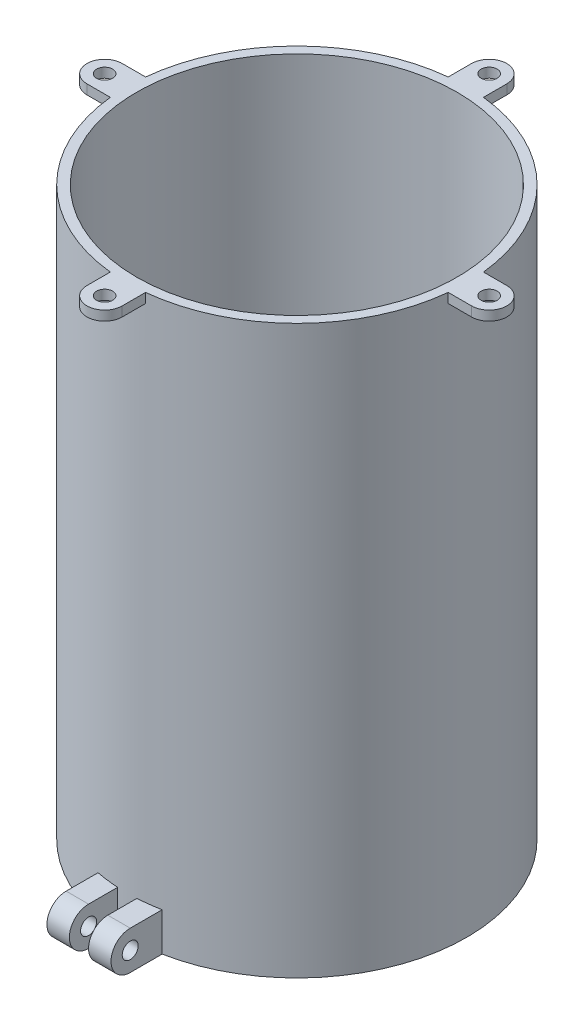
ISO-10303-21;
HEADER;
FILE_DESCRIPTION(('STEP AP214'),'2;1');
FILE_NAME('part.step','',(''),(''),'','','');
FILE_SCHEMA(('AUTOMOTIVE_DESIGN { 1 0 10303 214 1 1 1 1 }'));
ENDSEC;
DATA;
#1=APPLICATION_CONTEXT('core data for automotive mechanical design processes');
#2=APPLICATION_PROTOCOL_DEFINITION('international standard','automotive_design',2000,#1);
#3=PRODUCT_CONTEXT('',#1,'mechanical');
#4=PRODUCT('Part','Part','',(#3));
#5=PRODUCT_RELATED_PRODUCT_CATEGORY('part','',(#4));
#6=PRODUCT_DEFINITION_FORMATION('','',#4);
#7=PRODUCT_DEFINITION_CONTEXT('part definition',#1,'design');
#8=PRODUCT_DEFINITION('design','',#6,#7);
#9=PRODUCT_DEFINITION_SHAPE('','',#8);
#10=(LENGTH_UNIT() NAMED_UNIT(*) SI_UNIT(.MILLI.,.METRE.));
#11=(NAMED_UNIT(*) PLANE_ANGLE_UNIT() SI_UNIT($,.RADIAN.));
#12=(NAMED_UNIT(*) SI_UNIT($,.STERADIAN.) SOLID_ANGLE_UNIT());
#13=UNCERTAINTY_MEASURE_WITH_UNIT(LENGTH_MEASURE(1.E-05),#10,'distance_accuracy_value','');
#14=(GEOMETRIC_REPRESENTATION_CONTEXT(3) GLOBAL_UNCERTAINTY_ASSIGNED_CONTEXT((#13)) GLOBAL_UNIT_ASSIGNED_CONTEXT((#10,
#11,#12)) REPRESENTATION_CONTEXT('',''));
#15=CARTESIAN_POINT('',(0.,0.,0.));
#16=DIRECTION('',(0.,0.,1.));
#17=DIRECTION('',(1.,0.,0.));
#18=AXIS2_PLACEMENT_3D('',#15,#16,#17);
#19=CARTESIAN_POINT('',(-3.,0.,51.));
#20=DIRECTION('',(-1.,0.,0.));
#21=DIRECTION('',(0.,-1.,0.));
#22=AXIS2_PLACEMENT_3D('',#19,#20,#21);
#23=PLANE('',#22);
#24=CARTESIAN_POINT('',(-3.,6.,62.));
#25=DIRECTION('',(-1.,0.,0.));
#26=DIRECTION('',(0.,-1.,0.));
#27=AXIS2_PLACEMENT_3D('',#24,#25,#26);
#28=CIRCLE('',#27,2.5);
#29=CARTESIAN_POINT('',(-3.,3.5,62.));
#30=VERTEX_POINT('',#29);
#31=EDGE_CURVE('E452',#30,#30,#28,.T.);
#32=ORIENTED_EDGE('',*,*,#31,.T.);
#33=EDGE_LOOP('',(#32));
#34=FACE_BOUND('',#33,.T.);
#35=CARTESIAN_POINT('',(-3.,6.,62.));
#36=DIRECTION('',(-1.,0.,0.));
#37=DIRECTION('',(0.,-1.,0.));
#38=AXIS2_PLACEMENT_3D('',#35,#36,#37);
#39=CIRCLE('',#38,6.);
#40=CARTESIAN_POINT('',(-3.,0.,62.));
#41=VERTEX_POINT('',#40);
#42=CARTESIAN_POINT('',(-3.,12.,62.));
#43=VERTEX_POINT('',#42);
#44=EDGE_CURVE('E458',#41,#43,#39,.T.);
#45=ORIENTED_EDGE('',*,*,#44,.F.);
#46=DIRECTION('',(0.,0.,1.));
#47=VECTOR('',#46,1.);
#48=CARTESIAN_POINT('',(-3.,0.,51.));
#49=LINE('',#48,#47);
#50=CARTESIAN_POINT('',(-3.,0.,52.9150262212918));
#51=VERTEX_POINT('',#50);
#52=EDGE_CURVE('E267',#51,#41,#49,.T.);
#53=ORIENTED_EDGE('',*,*,#52,.F.);
#54=DIRECTION('',(0.,-1.,0.));
#55=VECTOR('',#54,1.);
#56=CARTESIAN_POINT('',(-3.00000000000002,176.9,52.9150262212918));
#57=LINE('',#56,#55);
#58=CARTESIAN_POINT('',(-3.,12.,52.9150262212918));
#59=VERTEX_POINT('',#58);
#60=EDGE_CURVE('E282',#51,#59,#57,.F.);
#61=ORIENTED_EDGE('',*,*,#60,.T.);
#62=DIRECTION('',(0.,0.,1.));
#63=VECTOR('',#62,1.);
#64=CARTESIAN_POINT('',(-3.,12.,51.));
#65=LINE('',#64,#63);
#66=EDGE_CURVE('E274',#59,#43,#65,.T.);
#67=ORIENTED_EDGE('',*,*,#66,.T.);
#68=EDGE_LOOP('',(#45,#53,#61,#67));
#69=FACE_BOUND('',#68,.T.);
#70=ADVANCED_FACE('F84',(#34,#69),#23,.F.);
#71=CARTESIAN_POINT('',(-10.,0.,51.));
#72=DIRECTION('',(1.,0.,0.));
#73=DIRECTION('',(0.,0.,-1.));
#74=AXIS2_PLACEMENT_3D('',#71,#72,#73);
#75=PLANE('',#74);
#76=CARTESIAN_POINT('',(-10.,6.,62.));
#77=DIRECTION('',(-1.,0.,0.));
#78=DIRECTION('',(0.,0.,1.));
#79=AXIS2_PLACEMENT_3D('',#76,#77,#78);
#80=CIRCLE('',#79,2.5);
#81=CARTESIAN_POINT('',(-10.,6.,64.5));
#82=VERTEX_POINT('',#81);
#83=EDGE_CURVE('E465',#82,#82,#80,.T.);
#84=ORIENTED_EDGE('',*,*,#83,.F.);
#85=EDGE_LOOP('',(#84));
#86=FACE_BOUND('',#85,.T.);
#87=DIRECTION('',(0.,0.,1.));
#88=VECTOR('',#87,1.);
#89=CARTESIAN_POINT('',(-10.,0.,51.));
#90=LINE('',#89,#88);
#91=CARTESIAN_POINT('',(-10.,0.,52.0480547186924));
#92=VERTEX_POINT('',#91);
#93=CARTESIAN_POINT('',(-10.,0.,62.));
#94=VERTEX_POINT('',#93);
#95=EDGE_CURVE('E264',#92,#94,#90,.T.);
#96=ORIENTED_EDGE('',*,*,#95,.T.);
#97=CARTESIAN_POINT('',(-10.,6.,62.));
#98=DIRECTION('',(-1.,0.,0.));
#99=DIRECTION('',(0.,0.,1.));
#100=AXIS2_PLACEMENT_3D('',#97,#98,#99);
#101=CIRCLE('',#100,6.);
#102=CARTESIAN_POINT('',(-10.,12.,62.));
#103=VERTEX_POINT('',#102);
#104=EDGE_CURVE('E248',#94,#103,#101,.T.);
#105=ORIENTED_EDGE('',*,*,#104,.T.);
#106=DIRECTION('',(0.,0.,1.));
#107=VECTOR('',#106,1.);
#108=CARTESIAN_POINT('',(-10.,12.,51.));
#109=LINE('',#108,#107);
#110=CARTESIAN_POINT('',(-10.,12.,52.0480547186924));
#111=VERTEX_POINT('',#110);
#112=EDGE_CURVE('E271',#111,#103,#109,.T.);
#113=ORIENTED_EDGE('',*,*,#112,.F.);
#114=DIRECTION('',(0.,-1.,0.));
#115=VECTOR('',#114,1.);
#116=CARTESIAN_POINT('',(-10.,176.9,52.0480547186924));
#117=LINE('',#116,#115);
#118=EDGE_CURVE('E270',#111,#92,#117,.T.);
#119=ORIENTED_EDGE('',*,*,#118,.T.);
#120=EDGE_LOOP('',(#96,#105,#113,#119));
#121=FACE_BOUND('',#120,.T.);
#122=ADVANCED_FACE('F269',(#86,#121),#75,.F.);
#123=CARTESIAN_POINT('',(3.,0.,68.));
#124=DIRECTION('',(1.,0.,0.));
#125=DIRECTION('',(0.,1.,0.));
#126=AXIS2_PLACEMENT_3D('',#123,#124,#125);
#127=PLANE('',#126);
#128=CARTESIAN_POINT('',(3.,6.,62.));
#129=DIRECTION('',(1.,0.,0.));
#130=DIRECTION('',(0.,1.,0.));
#131=AXIS2_PLACEMENT_3D('',#128,#129,#130);
#132=CIRCLE('',#131,2.5);
#133=CARTESIAN_POINT('',(3.,8.5,62.));
#134=VERTEX_POINT('',#133);
#135=EDGE_CURVE('E455',#134,#134,#132,.T.);
#136=ORIENTED_EDGE('',*,*,#135,.T.);
#137=EDGE_LOOP('',(#136));
#138=FACE_BOUND('',#137,.T.);
#139=DIRECTION('',(0.,0.,-1.));
#140=VECTOR('',#139,1.);
#141=CARTESIAN_POINT('',(3.,0.,68.));
#142=LINE('',#141,#140);
#143=CARTESIAN_POINT('',(3.,0.,62.));
#144=VERTEX_POINT('',#143);
#145=CARTESIAN_POINT('',(3.,0.,52.9150262212918));
#146=VERTEX_POINT('',#145);
#147=EDGE_CURVE('E446',#144,#146,#142,.T.);
#148=ORIENTED_EDGE('',*,*,#147,.F.);
#149=CARTESIAN_POINT('',(3.,6.,62.));
#150=DIRECTION('',(1.,0.,0.));
#151=DIRECTION('',(0.,1.,0.));
#152=AXIS2_PLACEMENT_3D('',#149,#150,#151);
#153=CIRCLE('',#152,6.);
#154=CARTESIAN_POINT('',(3.,12.,62.));
#155=VERTEX_POINT('',#154);
#156=EDGE_CURVE('E460',#155,#144,#153,.T.);
#157=ORIENTED_EDGE('',*,*,#156,.F.);
#158=DIRECTION('',(0.,0.,-1.));
#159=VECTOR('',#158,1.);
#160=CARTESIAN_POINT('',(3.,12.,68.));
#161=LINE('',#160,#159);
#162=CARTESIAN_POINT('',(3.,12.,52.9150262212918));
#163=VERTEX_POINT('',#162);
#164=EDGE_CURVE('E99',#155,#163,#161,.T.);
#165=ORIENTED_EDGE('',*,*,#164,.T.);
#166=DIRECTION('',(0.,-1.,0.));
#167=VECTOR('',#166,1.);
#168=CARTESIAN_POINT('',(2.99999999999998,176.9,52.9150262212918));
#169=LINE('',#168,#167);
#170=EDGE_CURVE('E280',#163,#146,#169,.T.);
#171=ORIENTED_EDGE('',*,*,#170,.T.);
#172=EDGE_LOOP('',(#148,#157,#165,#171));
#173=FACE_BOUND('',#172,.T.);
#174=ADVANCED_FACE('F476',(#138,#173),#127,.F.);
#175=CARTESIAN_POINT('',(10.,0.,68.));
#176=DIRECTION('',(-1.,0.,0.));
#177=DIRECTION('',(0.,-1.,0.));
#178=AXIS2_PLACEMENT_3D('',#175,#176,#177);
#179=PLANE('',#178);
#180=CARTESIAN_POINT('',(10.,6.,62.));
#181=DIRECTION('',(-1.,0.,0.));
#182=DIRECTION('',(0.,-1.,0.));
#183=AXIS2_PLACEMENT_3D('',#180,#181,#182);
#184=CIRCLE('',#183,2.5);
#185=CARTESIAN_POINT('',(10.,3.5,62.));
#186=VERTEX_POINT('',#185);
#187=EDGE_CURVE('E462',#186,#186,#184,.F.);
#188=ORIENTED_EDGE('',*,*,#187,.F.);
#189=EDGE_LOOP('',(#188));
#190=FACE_BOUND('',#189,.T.);
#191=CARTESIAN_POINT('',(10.,6.,62.));
#192=DIRECTION('',(-1.,0.,0.));
#193=DIRECTION('',(0.,-1.,0.));
#194=AXIS2_PLACEMENT_3D('',#191,#192,#193);
#195=CIRCLE('',#194,6.);
#196=CARTESIAN_POINT('',(10.,12.,62.));
#197=VERTEX_POINT('',#196);
#198=CARTESIAN_POINT('',(10.,0.,62.));
#199=VERTEX_POINT('',#198);
#200=EDGE_CURVE('E468',#197,#199,#195,.F.);
#201=ORIENTED_EDGE('',*,*,#200,.T.);
#202=DIRECTION('',(0.,0.,-1.));
#203=VECTOR('',#202,1.);
#204=CARTESIAN_POINT('',(10.,0.,68.));
#205=LINE('',#204,#203);
#206=CARTESIAN_POINT('',(10.,0.,52.0480547186924));
#207=VERTEX_POINT('',#206);
#208=EDGE_CURVE('E107',#199,#207,#205,.T.);
#209=ORIENTED_EDGE('',*,*,#208,.T.);
#210=DIRECTION('',(0.,-1.,0.));
#211=VECTOR('',#210,1.);
#212=CARTESIAN_POINT('',(9.99999999999998,176.9,52.0480547186924));
#213=LINE('',#212,#211);
#214=CARTESIAN_POINT('',(10.,12.,52.0480547186924));
#215=VERTEX_POINT('',#214);
#216=EDGE_CURVE('E440',#207,#215,#213,.F.);
#217=ORIENTED_EDGE('',*,*,#216,.T.);
#218=DIRECTION('',(0.,0.,-1.));
#219=VECTOR('',#218,1.);
#220=CARTESIAN_POINT('',(10.,12.,68.));
#221=LINE('',#220,#219);
#222=EDGE_CURVE('E444',#197,#215,#221,.T.);
#223=ORIENTED_EDGE('',*,*,#222,.F.);
#224=EDGE_LOOP('',(#201,#209,#217,#223));
#225=FACE_BOUND('',#224,.T.);
#226=ADVANCED_FACE('F443',(#190,#225),#179,.F.);
#227=CARTESIAN_POINT('',(0.,12.,51.));
#228=DIRECTION('',(0.,-1.,0.));
#229=DIRECTION('',(0.,0.,-1.));
#230=AXIS2_PLACEMENT_3D('',#227,#228,#229);
#231=PLANE('',#230);
#232=DIRECTION('',(-1.,0.,0.));
#233=VECTOR('',#232,1.);
#234=CARTESIAN_POINT('',(18.4852813742386,12.,62.));
#235=LINE('',#234,#233);
#236=EDGE_CURVE('E252',#43,#103,#235,.T.);
#237=ORIENTED_EDGE('',*,*,#236,.F.);
#238=ORIENTED_EDGE('',*,*,#66,.F.);
#239=CARTESIAN_POINT('',(0.,12.,0.));
#240=DIRECTION('',(0.,-1.,0.));
#241=DIRECTION('',(0.,0.,-1.));
#242=AXIS2_PLACEMENT_3D('',#239,#240,#241);
#243=CIRCLE('',#242,53.);
#244=EDGE_CURVE('E430',#59,#111,#243,.T.);
#245=ORIENTED_EDGE('',*,*,#244,.T.);
#246=ORIENTED_EDGE('',*,*,#112,.T.);
#247=EDGE_LOOP('',(#237,#238,#245,#246));
#248=FACE_BOUND('',#247,.T.);
#249=ADVANCED_FACE('F504',(#248),#231,.F.);
#250=CARTESIAN_POINT('',(0.,176.9,0.));
#251=DIRECTION('',(0.,-1.,0.));
#252=DIRECTION('',(0.,0.,-1.));
#253=AXIS2_PLACEMENT_3D('',#250,#251,#252);
#254=CYLINDRICAL_SURFACE('',#253,53.);
#255=DIRECTION('',(0.,1.,0.));
#256=VECTOR('',#255,1.);
#257=CARTESIAN_POINT('',(-5.49999999997042,173.9,52.7138501724198));
#258=LINE('',#257,#256);
#259=CARTESIAN_POINT('',(-5.49999999997042,173.9,52.7138501724198));
#260=VERTEX_POINT('',#259);
#261=CARTESIAN_POINT('',(-5.49999999997042,176.9,52.7138501724198));
#262=VERTEX_POINT('',#261);
#263=EDGE_CURVE('E309',#260,#262,#258,.T.);
#264=ORIENTED_EDGE('',*,*,#263,.T.);
#265=CARTESIAN_POINT('',(0.,176.9,0.));
#266=DIRECTION('',(0.,1.,0.));
#267=DIRECTION('',(0.,0.,1.));
#268=AXIS2_PLACEMENT_3D('',#265,#266,#267);
#269=CIRCLE('',#268,53.);
#270=CARTESIAN_POINT('',(-52.7138501724153,176.9,5.50000000001421));
#271=VERTEX_POINT('',#270);
#272=EDGE_CURVE('E427',#271,#262,#269,.T.);
#273=ORIENTED_EDGE('',*,*,#272,.F.);
#274=DIRECTION('',(0.,1.,0.));
#275=VECTOR('',#274,1.);
#276=CARTESIAN_POINT('',(-52.7138501724153,173.9,5.50000000001421));
#277=LINE('',#276,#275);
#278=CARTESIAN_POINT('',(-52.7138501724153,173.9,5.50000000001421));
#279=VERTEX_POINT('',#278);
#280=EDGE_CURVE('E415',#279,#271,#277,.T.);
#281=ORIENTED_EDGE('',*,*,#280,.F.);
#282=CARTESIAN_POINT('',(0.,173.9,0.));
#283=DIRECTION('',(0.,1.,0.));
#284=DIRECTION('',(0.,0.,1.));
#285=AXIS2_PLACEMENT_3D('',#282,#283,#284);
#286=CIRCLE('',#285,53.);
#287=CARTESIAN_POINT('',(-52.7138501724182,173.9,-5.49999999998579));
#288=VERTEX_POINT('',#287);
#289=EDGE_CURVE('E399',#288,#279,#286,.T.);
#290=ORIENTED_EDGE('',*,*,#289,.F.);
#291=DIRECTION('',(0.,1.,0.));
#292=VECTOR('',#291,1.);
#293=CARTESIAN_POINT('',(-52.7138501724182,173.9,-5.49999999998579));
#294=LINE('',#293,#292);
#295=CARTESIAN_POINT('',(-52.7138501724182,176.9,-5.49999999998579));
#296=VERTEX_POINT('',#295);
#297=EDGE_CURVE('E411',#288,#296,#294,.T.);
#298=ORIENTED_EDGE('',*,*,#297,.T.);
#299=CARTESIAN_POINT('',(-5.5,176.9,-52.7138501724167));
#300=VERTEX_POINT('',#299);
#301=EDGE_CURVE('E432',#300,#296,#269,.T.);
#302=ORIENTED_EDGE('',*,*,#301,.F.);
#303=DIRECTION('',(0.,1.,0.));
#304=VECTOR('',#303,1.);
#305=CARTESIAN_POINT('',(-5.5,173.9,-52.7138501724167));
#306=LINE('',#305,#304);
#307=CARTESIAN_POINT('',(-5.5,173.9,-52.7138501724167));
#308=VERTEX_POINT('',#307);
#309=EDGE_CURVE('E381',#308,#300,#306,.T.);
#310=ORIENTED_EDGE('',*,*,#309,.F.);
#311=CARTESIAN_POINT('',(0.,173.9,0.));
#312=DIRECTION('',(0.,1.,0.));
#313=DIRECTION('',(0.,0.,1.));
#314=AXIS2_PLACEMENT_3D('',#311,#312,#313);
#315=CIRCLE('',#314,53.);
#316=CARTESIAN_POINT('',(5.5,173.9,-52.7138501724167));
#317=VERTEX_POINT('',#316);
#318=EDGE_CURVE('E365',#317,#308,#315,.T.);
#319=ORIENTED_EDGE('',*,*,#318,.F.);
#320=DIRECTION('',(0.,1.,0.));
#321=VECTOR('',#320,1.);
#322=CARTESIAN_POINT('',(5.5,173.9,-52.7138501724167));
#323=LINE('',#322,#321);
#324=CARTESIAN_POINT('',(5.5,176.9,-52.7138501724167));
#325=VERTEX_POINT('',#324);
#326=EDGE_CURVE('E377',#317,#325,#323,.T.);
#327=ORIENTED_EDGE('',*,*,#326,.T.);
#328=CARTESIAN_POINT('',(52.7138501724151,176.9,-5.50000000001537));
#329=VERTEX_POINT('',#328);
#330=EDGE_CURVE('E889',#329,#325,#269,.T.);
#331=ORIENTED_EDGE('',*,*,#330,.F.);
#332=DIRECTION('',(0.,1.,0.));
#333=VECTOR('',#332,1.);
#334=CARTESIAN_POINT('',(52.7138501724151,173.9,-5.50000000001537));
#335=LINE('',#334,#333);
#336=CARTESIAN_POINT('',(52.7138501724151,173.9,-5.50000000001537));
#337=VERTEX_POINT('',#336);
#338=EDGE_CURVE('E347',#337,#329,#335,.T.);
#339=ORIENTED_EDGE('',*,*,#338,.F.);
#340=CARTESIAN_POINT('',(0.,173.9,0.));
#341=DIRECTION('',(0.,1.,0.));
#342=DIRECTION('',(0.,0.,1.));
#343=AXIS2_PLACEMENT_3D('',#340,#341,#342);
#344=CIRCLE('',#343,53.);
#345=CARTESIAN_POINT('',(52.7138501724183,173.9,5.49999999998463));
#346=VERTEX_POINT('',#345);
#347=EDGE_CURVE('E331',#346,#337,#344,.T.);
#348=ORIENTED_EDGE('',*,*,#347,.F.);
#349=DIRECTION('',(0.,1.,0.));
#350=VECTOR('',#349,1.);
#351=CARTESIAN_POINT('',(52.7138501724183,173.9,5.49999999998463));
#352=LINE('',#351,#350);
#353=CARTESIAN_POINT('',(52.7138501724183,176.9,5.49999999998463));
#354=VERTEX_POINT('',#353);
#355=EDGE_CURVE('E343',#346,#354,#352,.T.);
#356=ORIENTED_EDGE('',*,*,#355,.T.);
#357=CARTESIAN_POINT('',(5.50000000002958,176.9,52.7138501724137));
#358=VERTEX_POINT('',#357);
#359=EDGE_CURVE('E431',#358,#354,#269,.T.);
#360=ORIENTED_EDGE('',*,*,#359,.F.);
#361=DIRECTION('',(0.,1.,0.));
#362=VECTOR('',#361,1.);
#363=CARTESIAN_POINT('',(5.50000000002958,173.9,52.7138501724137));
#364=LINE('',#363,#362);
#365=CARTESIAN_POINT('',(5.50000000002958,173.9,52.7138501724137));
#366=VERTEX_POINT('',#365);
#367=EDGE_CURVE('E313',#366,#358,#364,.T.);
#368=ORIENTED_EDGE('',*,*,#367,.F.);
#369=CARTESIAN_POINT('',(0.,173.9,0.));
#370=DIRECTION('',(0.,1.,0.));
#371=DIRECTION('',(0.,0.,1.));
#372=AXIS2_PLACEMENT_3D('',#369,#370,#371);
#373=CIRCLE('',#372,53.);
#374=EDGE_CURVE('E298',#260,#366,#373,.T.);
#375=ORIENTED_EDGE('',*,*,#374,.F.);
#376=EDGE_LOOP('',(#264,#273,#281,#290,#298,#302,#310,#319,#327,#331,#339,#348,#356,#360,#368,#375));
#377=FACE_BOUND('',#376,.T.);
#378=ORIENTED_EDGE('',*,*,#170,.F.);
#379=CARTESIAN_POINT('',(0.,12.,0.));
#380=DIRECTION('',(0.,1.,0.));
#381=DIRECTION('',(0.,0.,1.));
#382=AXIS2_PLACEMENT_3D('',#379,#380,#381);
#383=CIRCLE('',#382,53.);
#384=EDGE_CURVE('E92',#163,#215,#383,.T.);
#385=ORIENTED_EDGE('',*,*,#384,.T.);
#386=ORIENTED_EDGE('',*,*,#216,.F.);
#387=CARTESIAN_POINT('',(0.,0.,0.));
#388=DIRECTION('',(0.,1.,0.));
#389=DIRECTION('',(0.,0.,1.));
#390=AXIS2_PLACEMENT_3D('',#387,#388,#389);
#391=CIRCLE('',#390,53.);
#392=EDGE_CURVE('E424',#207,#92,#391,.T.);
#393=ORIENTED_EDGE('',*,*,#392,.T.);
#394=ORIENTED_EDGE('',*,*,#118,.F.);
#395=ORIENTED_EDGE('',*,*,#244,.F.);
#396=ORIENTED_EDGE('',*,*,#60,.F.);
#397=EDGE_CURVE('E433',#51,#146,#391,.T.);
#398=ORIENTED_EDGE('',*,*,#397,.T.);
#399=EDGE_LOOP('',(#378,#385,#386,#393,#394,#395,#396,#398));
#400=FACE_BOUND('',#399,.T.);
#401=ADVANCED_FACE('F86',(#377,#400),#254,.T.);
#402=CARTESIAN_POINT('',(0.,176.9,0.));
#403=DIRECTION('',(0.,1.,0.));
#404=DIRECTION('',(0.,0.,1.));
#405=AXIS2_PLACEMENT_3D('',#402,#403,#404);
#406=PLANE('',#405);
#407=ORIENTED_EDGE('',*,*,#272,.T.);
#408=DIRECTION('',(0.,0.,-1.));
#409=VECTOR('',#408,1.);
#410=CARTESIAN_POINT('',(-5.49999999997043,176.9,0.));
#411=LINE('',#410,#409);
#412=CARTESIAN_POINT('',(-5.49999999997042,176.9,59.9999999999988));
#413=VERTEX_POINT('',#412);
#414=EDGE_CURVE('E303',#413,#262,#411,.T.);
#415=ORIENTED_EDGE('',*,*,#414,.F.);
#416=CARTESIAN_POINT('',(2.95843831461994E-11,176.9,59.9999999999988));
#417=DIRECTION('',(0.,1.,0.));
#418=DIRECTION('',(0.,0.,1.));
#419=AXIS2_PLACEMENT_3D('',#416,#417,#418);
#420=CIRCLE('',#419,5.5);
#421=CARTESIAN_POINT('',(5.50000000002958,176.9,59.9999999999988));
#422=VERTEX_POINT('',#421);
#423=EDGE_CURVE('E305',#413,#422,#420,.T.);
#424=ORIENTED_EDGE('',*,*,#423,.T.);
#425=DIRECTION('',(0.,0.,-1.));
#426=VECTOR('',#425,1.);
#427=CARTESIAN_POINT('',(5.50000000002957,176.9,0.));
#428=LINE('',#427,#426);
#429=EDGE_CURVE('E290',#422,#358,#428,.T.);
#430=ORIENTED_EDGE('',*,*,#429,.T.);
#431=ORIENTED_EDGE('',*,*,#359,.T.);
#432=DIRECTION('',(-1.,0.,0.));
#433=VECTOR('',#432,1.);
#434=CARTESIAN_POINT('',(0.,176.9,5.49999999998463));
#435=LINE('',#434,#433);
#436=CARTESIAN_POINT('',(60.0000000000142,176.9,5.49999999998462));
#437=VERTEX_POINT('',#436);
#438=EDGE_CURVE('E336',#437,#354,#435,.T.);
#439=ORIENTED_EDGE('',*,*,#438,.F.);
#440=CARTESIAN_POINT('',(60.0000000000142,176.9,-1.53750586610279E-11));
#441=DIRECTION('',(0.,1.,0.));
#442=DIRECTION('',(0.,0.,1.));
#443=AXIS2_PLACEMENT_3D('',#440,#441,#442);
#444=CIRCLE('',#443,5.5);
#445=CARTESIAN_POINT('',(60.0000000000142,176.9,-5.50000000001537));
#446=VERTEX_POINT('',#445);
#447=EDGE_CURVE('E339',#437,#446,#444,.T.);
#448=ORIENTED_EDGE('',*,*,#447,.T.);
#449=DIRECTION('',(-1.,0.,0.));
#450=VECTOR('',#449,1.);
#451=CARTESIAN_POINT('',(0.,176.9,-5.50000000001537));
#452=LINE('',#451,#450);
#453=EDGE_CURVE('E323',#446,#329,#452,.T.);
#454=ORIENTED_EDGE('',*,*,#453,.T.);
#455=ORIENTED_EDGE('',*,*,#330,.T.);
#456=DIRECTION('',(0.,0.,1.));
#457=VECTOR('',#456,1.);
#458=CARTESIAN_POINT('',(5.5,176.9,0.));
#459=LINE('',#458,#457);
#460=CARTESIAN_POINT('',(5.5,176.9,-60.));
#461=VERTEX_POINT('',#460);
#462=EDGE_CURVE('E370',#461,#325,#459,.T.);
#463=ORIENTED_EDGE('',*,*,#462,.F.);
#464=CARTESIAN_POINT('',(0.,176.9,-60.));
#465=DIRECTION('',(0.,1.,0.));
#466=DIRECTION('',(0.,0.,1.));
#467=AXIS2_PLACEMENT_3D('',#464,#465,#466);
#468=CIRCLE('',#467,5.5);
#469=CARTESIAN_POINT('',(-5.5,176.9,-60.));
#470=VERTEX_POINT('',#469);
#471=EDGE_CURVE('E373',#461,#470,#468,.T.);
#472=ORIENTED_EDGE('',*,*,#471,.T.);
#473=DIRECTION('',(0.,0.,1.));
#474=VECTOR('',#473,1.);
#475=CARTESIAN_POINT('',(-5.5,176.9,0.));
#476=LINE('',#475,#474);
#477=EDGE_CURVE('E357',#470,#300,#476,.T.);
#478=ORIENTED_EDGE('',*,*,#477,.T.);
#479=ORIENTED_EDGE('',*,*,#301,.T.);
#480=DIRECTION('',(1.,0.,0.));
#481=VECTOR('',#480,1.);
#482=CARTESIAN_POINT('',(0.,176.9,-5.4999999999858));
#483=LINE('',#482,#481);
#484=CARTESIAN_POINT('',(-59.9999999999846,176.9,-5.49999999998578));
#485=VERTEX_POINT('',#484);
#486=EDGE_CURVE('E404',#485,#296,#483,.T.);
#487=ORIENTED_EDGE('',*,*,#486,.F.);
#488=CARTESIAN_POINT('',(-59.9999999999846,176.9,1.42166723659664E-11));
#489=DIRECTION('',(0.,1.,0.));
#490=DIRECTION('',(0.,0.,1.));
#491=AXIS2_PLACEMENT_3D('',#488,#489,#490);
#492=CIRCLE('',#491,5.5);
#493=CARTESIAN_POINT('',(-59.9999999999846,176.9,5.50000000001422));
#494=VERTEX_POINT('',#493);
#495=EDGE_CURVE('E407',#485,#494,#492,.T.);
#496=ORIENTED_EDGE('',*,*,#495,.T.);
#497=DIRECTION('',(1.,0.,0.));
#498=VECTOR('',#497,1.);
#499=CARTESIAN_POINT('',(0.,176.9,5.50000000001419));
#500=LINE('',#499,#498);
#501=EDGE_CURVE('E391',#494,#271,#500,.T.);
#502=ORIENTED_EDGE('',*,*,#501,.T.);
#503=EDGE_LOOP('',(#407,#415,#424,#430,#431,#439,#448,#454,#455,#463,#472,#478,#479,#487,#496,#502));
#504=FACE_BOUND('',#503,.T.);
#505=CARTESIAN_POINT('',(0.,176.9,0.));
#506=DIRECTION('',(0.,1.,0.));
#507=DIRECTION('',(0.,0.,1.));
#508=AXIS2_PLACEMENT_3D('',#505,#506,#507);
#509=CIRCLE('',#508,50.);
#510=CARTESIAN_POINT('',(0.,176.9,50.));
#511=VERTEX_POINT('',#510);
#512=EDGE_CURVE('E421',#511,#511,#509,.T.);
#513=ORIENTED_EDGE('',*,*,#512,.F.);
#514=EDGE_LOOP('',(#513));
#515=FACE_BOUND('',#514,.T.);
#516=CARTESIAN_POINT('',(-59.9999999999846,176.9,1.42166723659664E-11));
#517=DIRECTION('',(0.,1.,0.));
#518=DIRECTION('',(0.,0.,1.));
#519=AXIS2_PLACEMENT_3D('',#516,#517,#518);
#520=CIRCLE('',#519,2.50000000001868);
#521=CARTESIAN_POINT('',(-59.9999999999846,176.9,2.5000000000329));
#522=VERTEX_POINT('',#521);
#523=EDGE_CURVE('E380',#522,#522,#520,.T.);
#524=ORIENTED_EDGE('',*,*,#523,.F.);
#525=EDGE_LOOP('',(#524));
#526=FACE_BOUND('',#525,.T.);
#527=CARTESIAN_POINT('',(0.,176.9,-60.));
#528=DIRECTION('',(0.,1.,0.));
#529=DIRECTION('',(0.,0.,1.));
#530=AXIS2_PLACEMENT_3D('',#527,#528,#529);
#531=CIRCLE('',#530,2.5);
#532=CARTESIAN_POINT('',(0.,176.9,-57.5));
#533=VERTEX_POINT('',#532);
#534=EDGE_CURVE('E346',#533,#533,#531,.T.);
#535=ORIENTED_EDGE('',*,*,#534,.F.);
#536=EDGE_LOOP('',(#535));
#537=FACE_BOUND('',#536,.T.);
#538=CARTESIAN_POINT('',(60.0000000000142,176.9,-1.53750586610279E-11));
#539=DIRECTION('',(0.,1.,0.));
#540=DIRECTION('',(0.,0.,1.));
#541=AXIS2_PLACEMENT_3D('',#538,#539,#540);
#542=CIRCLE('',#541,2.50000000001075);
#543=CARTESIAN_POINT('',(60.0000000000142,176.9,2.49999999999538));
#544=VERTEX_POINT('',#543);
#545=EDGE_CURVE('E312',#544,#544,#542,.T.);
#546=ORIENTED_EDGE('',*,*,#545,.F.);
#547=EDGE_LOOP('',(#546));
#548=FACE_BOUND('',#547,.T.);
#549=CARTESIAN_POINT('',(2.95843831461994E-11,176.9,59.9999999999988));
#550=DIRECTION('',(0.,1.,0.));
#551=DIRECTION('',(0.,0.,1.));
#552=AXIS2_PLACEMENT_3D('',#549,#550,#551);
#553=CIRCLE('',#552,2.50000000002903);
#554=CARTESIAN_POINT('',(2.95843831461994E-11,176.9,62.5000000000279));
#555=VERTEX_POINT('',#554);
#556=EDGE_CURVE('E285',#555,#555,#553,.T.);
#557=ORIENTED_EDGE('',*,*,#556,.F.);
#558=EDGE_LOOP('',(#557));
#559=FACE_BOUND('',#558,.T.);
#560=ADVANCED_FACE('F588',(#504,#515,#526,#537,#548,#559),#406,.T.);
#561=CARTESIAN_POINT('',(0.,0.,0.));
#562=DIRECTION('',(0.,1.,0.));
#563=DIRECTION('',(0.,0.,1.));
#564=AXIS2_PLACEMENT_3D('',#561,#562,#563);
#565=PLANE('',#564);
#566=ORIENTED_EDGE('',*,*,#208,.F.);
#567=DIRECTION('',(-1.,0.,0.));
#568=VECTOR('',#567,1.);
#569=CARTESIAN_POINT('',(18.4852813742386,0.,62.));
#570=LINE('',#569,#568);
#571=EDGE_CURVE('E257',#199,#144,#570,.T.);
#572=ORIENTED_EDGE('',*,*,#571,.T.);
#573=ORIENTED_EDGE('',*,*,#147,.T.);
#574=ORIENTED_EDGE('',*,*,#397,.F.);
#575=ORIENTED_EDGE('',*,*,#52,.T.);
#576=DIRECTION('',(-1.,0.,0.));
#577=VECTOR('',#576,1.);
#578=CARTESIAN_POINT('',(18.4852813742386,0.,62.));
#579=LINE('',#578,#577);
#580=EDGE_CURVE('E12',#41,#94,#579,.T.);
#581=ORIENTED_EDGE('',*,*,#580,.T.);
#582=ORIENTED_EDGE('',*,*,#95,.F.);
#583=ORIENTED_EDGE('',*,*,#392,.F.);
#584=EDGE_LOOP('',(#566,#572,#573,#574,#575,#581,#582,#583));
#585=FACE_BOUND('',#584,.T.);
#586=CARTESIAN_POINT('',(0.,0.,0.));
#587=DIRECTION('',(0.,1.,0.));
#588=DIRECTION('',(0.,0.,1.));
#589=AXIS2_PLACEMENT_3D('',#586,#587,#588);
#590=CIRCLE('',#589,50.);
#591=CARTESIAN_POINT('',(0.,0.,50.));
#592=VERTEX_POINT('',#591);
#593=EDGE_CURVE('E414',#592,#592,#590,.T.);
#594=ORIENTED_EDGE('',*,*,#593,.T.);
#595=EDGE_LOOP('',(#594));
#596=FACE_BOUND('',#595,.T.);
#597=ADVANCED_FACE('F261',(#585,#596),#565,.F.);
#598=CARTESIAN_POINT('',(0.,176.9,0.));
#599=DIRECTION('',(0.,-1.,0.));
#600=DIRECTION('',(0.,0.,-1.));
#601=AXIS2_PLACEMENT_3D('',#598,#599,#600);
#602=CYLINDRICAL_SURFACE('',#601,50.);
#603=ORIENTED_EDGE('',*,*,#512,.T.);
#604=EDGE_LOOP('',(#603));
#605=FACE_BOUND('',#604,.T.);
#606=ORIENTED_EDGE('',*,*,#593,.F.);
#607=EDGE_LOOP('',(#606));
#608=FACE_BOUND('',#607,.T.);
#609=ADVANCED_FACE('F580',(#605,#608),#602,.F.);
#610=CARTESIAN_POINT('',(0.,173.9,-5.4999999999858));
#611=DIRECTION('',(0.,0.,1.));
#612=DIRECTION('',(1.,0.,0.));
#613=AXIS2_PLACEMENT_3D('',#610,#611,#612);
#614=PLANE('',#613);
#615=ORIENTED_EDGE('',*,*,#486,.T.);
#616=ORIENTED_EDGE('',*,*,#297,.F.);
#617=DIRECTION('',(1.,0.,0.));
#618=VECTOR('',#617,1.);
#619=CARTESIAN_POINT('',(0.,173.9,-5.4999999999858));
#620=LINE('',#619,#618);
#621=CARTESIAN_POINT('',(-59.9999999999846,173.9,-5.49999999998578));
#622=VERTEX_POINT('',#621);
#623=EDGE_CURVE('E390',#622,#288,#620,.T.);
#624=ORIENTED_EDGE('',*,*,#623,.F.);
#625=DIRECTION('',(0.,1.,0.));
#626=VECTOR('',#625,1.);
#627=CARTESIAN_POINT('',(-59.9999999999846,173.9,-5.49999999998578));
#628=LINE('',#627,#626);
#629=EDGE_CURVE('E401',#622,#485,#628,.T.);
#630=ORIENTED_EDGE('',*,*,#629,.T.);
#631=EDGE_LOOP('',(#615,#616,#624,#630));
#632=FACE_BOUND('',#631,.T.);
#633=ADVANCED_FACE('F573',(#632),#614,.F.);
#634=CARTESIAN_POINT('',(0.,173.9,5.50000000001419));
#635=DIRECTION('',(0.,0.,1.));
#636=DIRECTION('',(1.,0.,0.));
#637=AXIS2_PLACEMENT_3D('',#634,#635,#636);
#638=PLANE('',#637);
#639=ORIENTED_EDGE('',*,*,#501,.F.);
#640=DIRECTION('',(0.,1.,0.));
#641=VECTOR('',#640,1.);
#642=CARTESIAN_POINT('',(-59.9999999999846,173.9,5.50000000001422));
#643=LINE('',#642,#641);
#644=CARTESIAN_POINT('',(-59.9999999999846,173.9,5.50000000001422));
#645=VERTEX_POINT('',#644);
#646=EDGE_CURVE('E418',#645,#494,#643,.T.);
#647=ORIENTED_EDGE('',*,*,#646,.F.);
#648=DIRECTION('',(1.,0.,0.));
#649=VECTOR('',#648,1.);
#650=CARTESIAN_POINT('',(0.,173.9,5.50000000001419));
#651=LINE('',#650,#649);
#652=EDGE_CURVE('E396',#645,#279,#651,.T.);
#653=ORIENTED_EDGE('',*,*,#652,.T.);
#654=ORIENTED_EDGE('',*,*,#280,.T.);
#655=EDGE_LOOP('',(#639,#647,#653,#654));
#656=FACE_BOUND('',#655,.T.);
#657=ADVANCED_FACE('F569',(#656),#638,.T.);
#658=CARTESIAN_POINT('',(-59.9999999999846,173.9,1.42166723659664E-11));
#659=DIRECTION('',(0.,1.,0.));
#660=DIRECTION('',(0.,0.,1.));
#661=AXIS2_PLACEMENT_3D('',#658,#659,#660);
#662=CYLINDRICAL_SURFACE('',#661,2.50000000001868);
#663=CARTESIAN_POINT('',(-59.9999999999846,173.9,1.42166723659664E-11));
#664=DIRECTION('',(0.,1.,0.));
#665=DIRECTION('',(0.,0.,1.));
#666=AXIS2_PLACEMENT_3D('',#663,#664,#665);
#667=CIRCLE('',#666,2.50000000001868);
#668=CARTESIAN_POINT('',(-59.9999999999846,173.9,2.5000000000329));
#669=VERTEX_POINT('',#668);
#670=EDGE_CURVE('E387',#669,#669,#667,.T.);
#671=ORIENTED_EDGE('',*,*,#670,.F.);
#672=EDGE_LOOP('',(#671));
#673=FACE_BOUND('',#672,.T.);
#674=ORIENTED_EDGE('',*,*,#523,.T.);
#675=EDGE_LOOP('',(#674));
#676=FACE_BOUND('',#675,.T.);
#677=ADVANCED_FACE('F572',(#673,#676),#662,.F.);
#678=CARTESIAN_POINT('',(-59.9999999999846,173.9,1.42166723659664E-11));
#679=DIRECTION('',(0.,1.,0.));
#680=DIRECTION('',(0.,0.,1.));
#681=AXIS2_PLACEMENT_3D('',#678,#679,#680);
#682=CYLINDRICAL_SURFACE('',#681,5.5);
#683=ORIENTED_EDGE('',*,*,#495,.F.);
#684=ORIENTED_EDGE('',*,*,#629,.F.);
#685=CARTESIAN_POINT('',(-59.9999999999846,173.9,1.42166723659664E-11));
#686=DIRECTION('',(0.,1.,0.));
#687=DIRECTION('',(0.,0.,1.));
#688=AXIS2_PLACEMENT_3D('',#685,#686,#687);
#689=CIRCLE('',#688,5.5);
#690=EDGE_CURVE('E393',#622,#645,#689,.T.);
#691=ORIENTED_EDGE('',*,*,#690,.T.);
#692=ORIENTED_EDGE('',*,*,#646,.T.);
#693=EDGE_LOOP('',(#683,#684,#691,#692));
#694=FACE_BOUND('',#693,.T.);
#695=ADVANCED_FACE('F567',(#694),#682,.T.);
#696=CARTESIAN_POINT('',(0.,173.9,0.));
#697=DIRECTION('',(0.,1.,0.));
#698=DIRECTION('',(0.,0.,1.));
#699=AXIS2_PLACEMENT_3D('',#696,#697,#698);
#700=PLANE('',#699);
#701=ORIENTED_EDGE('',*,*,#670,.T.);
#702=EDGE_LOOP('',(#701));
#703=FACE_BOUND('',#702,.T.);
#704=ORIENTED_EDGE('',*,*,#623,.T.);
#705=ORIENTED_EDGE('',*,*,#289,.T.);
#706=ORIENTED_EDGE('',*,*,#652,.F.);
#707=ORIENTED_EDGE('',*,*,#690,.F.);
#708=EDGE_LOOP('',(#704,#705,#706,#707));
#709=FACE_BOUND('',#708,.T.);
#710=ADVANCED_FACE('F560',(#703,#709),#700,.F.);
#711=CARTESIAN_POINT('',(5.5,173.9,0.));
#712=DIRECTION('',(-1.,0.,0.));
#713=DIRECTION('',(0.,0.,1.));
#714=AXIS2_PLACEMENT_3D('',#711,#712,#713);
#715=PLANE('',#714);
#716=ORIENTED_EDGE('',*,*,#462,.T.);
#717=ORIENTED_EDGE('',*,*,#326,.F.);
#718=DIRECTION('',(0.,0.,1.));
#719=VECTOR('',#718,1.);
#720=CARTESIAN_POINT('',(5.5,173.9,0.));
#721=LINE('',#720,#719);
#722=CARTESIAN_POINT('',(5.5,173.9,-60.));
#723=VERTEX_POINT('',#722);
#724=EDGE_CURVE('E356',#723,#317,#721,.T.);
#725=ORIENTED_EDGE('',*,*,#724,.F.);
#726=DIRECTION('',(0.,1.,0.));
#727=VECTOR('',#726,1.);
#728=CARTESIAN_POINT('',(5.5,173.9,-60.));
#729=LINE('',#728,#727);
#730=EDGE_CURVE('E367',#723,#461,#729,.T.);
#731=ORIENTED_EDGE('',*,*,#730,.T.);
#732=EDGE_LOOP('',(#716,#717,#725,#731));
#733=FACE_BOUND('',#732,.T.);
#734=ADVANCED_FACE('F553',(#733),#715,.F.);
#735=CARTESIAN_POINT('',(-5.5,173.9,0.));
#736=DIRECTION('',(-1.,0.,0.));
#737=DIRECTION('',(0.,0.,1.));
#738=AXIS2_PLACEMENT_3D('',#735,#736,#737);
#739=PLANE('',#738);
#740=ORIENTED_EDGE('',*,*,#477,.F.);
#741=DIRECTION('',(0.,1.,0.));
#742=VECTOR('',#741,1.);
#743=CARTESIAN_POINT('',(-5.5,173.9,-60.));
#744=LINE('',#743,#742);
#745=CARTESIAN_POINT('',(-5.5,173.9,-60.));
#746=VERTEX_POINT('',#745);
#747=EDGE_CURVE('E384',#746,#470,#744,.T.);
#748=ORIENTED_EDGE('',*,*,#747,.F.);
#749=DIRECTION('',(0.,0.,1.));
#750=VECTOR('',#749,1.);
#751=CARTESIAN_POINT('',(-5.5,173.9,0.));
#752=LINE('',#751,#750);
#753=EDGE_CURVE('E362',#746,#308,#752,.T.);
#754=ORIENTED_EDGE('',*,*,#753,.T.);
#755=ORIENTED_EDGE('',*,*,#309,.T.);
#756=EDGE_LOOP('',(#740,#748,#754,#755));
#757=FACE_BOUND('',#756,.T.);
#758=ADVANCED_FACE('F549',(#757),#739,.T.);
#759=CARTESIAN_POINT('',(0.,173.9,-60.));
#760=DIRECTION('',(0.,1.,0.));
#761=DIRECTION('',(0.,0.,1.));
#762=AXIS2_PLACEMENT_3D('',#759,#760,#761);
#763=CYLINDRICAL_SURFACE('',#762,2.5);
#764=CARTESIAN_POINT('',(0.,173.9,-60.));
#765=DIRECTION('',(0.,1.,0.));
#766=DIRECTION('',(0.,0.,1.));
#767=AXIS2_PLACEMENT_3D('',#764,#765,#766);
#768=CIRCLE('',#767,2.5);
#769=CARTESIAN_POINT('',(0.,173.9,-57.5));
#770=VERTEX_POINT('',#769);
#771=EDGE_CURVE('E353',#770,#770,#768,.T.);
#772=ORIENTED_EDGE('',*,*,#771,.F.);
#773=EDGE_LOOP('',(#772));
#774=FACE_BOUND('',#773,.T.);
#775=ORIENTED_EDGE('',*,*,#534,.T.);
#776=EDGE_LOOP('',(#775));
#777=FACE_BOUND('',#776,.T.);
#778=ADVANCED_FACE('F552',(#774,#777),#763,.F.);
#779=CARTESIAN_POINT('',(0.,173.9,-60.));
#780=DIRECTION('',(0.,1.,0.));
#781=DIRECTION('',(0.,0.,1.));
#782=AXIS2_PLACEMENT_3D('',#779,#780,#781);
#783=CYLINDRICAL_SURFACE('',#782,5.5);
#784=ORIENTED_EDGE('',*,*,#471,.F.);
#785=ORIENTED_EDGE('',*,*,#730,.F.);
#786=CARTESIAN_POINT('',(0.,173.9,-60.));
#787=DIRECTION('',(0.,1.,0.));
#788=DIRECTION('',(0.,0.,1.));
#789=AXIS2_PLACEMENT_3D('',#786,#787,#788);
#790=CIRCLE('',#789,5.5);
#791=EDGE_CURVE('E359',#723,#746,#790,.T.);
#792=ORIENTED_EDGE('',*,*,#791,.T.);
#793=ORIENTED_EDGE('',*,*,#747,.T.);
#794=EDGE_LOOP('',(#784,#785,#792,#793));
#795=FACE_BOUND('',#794,.T.);
#796=ADVANCED_FACE('F547',(#795),#783,.T.);
#797=CARTESIAN_POINT('',(0.,173.9,0.));
#798=DIRECTION('',(0.,1.,0.));
#799=DIRECTION('',(0.,0.,1.));
#800=AXIS2_PLACEMENT_3D('',#797,#798,#799);
#801=PLANE('',#800);
#802=ORIENTED_EDGE('',*,*,#771,.T.);
#803=EDGE_LOOP('',(#802));
#804=FACE_BOUND('',#803,.T.);
#805=ORIENTED_EDGE('',*,*,#724,.T.);
#806=ORIENTED_EDGE('',*,*,#318,.T.);
#807=ORIENTED_EDGE('',*,*,#753,.F.);
#808=ORIENTED_EDGE('',*,*,#791,.F.);
#809=EDGE_LOOP('',(#805,#806,#807,#808));
#810=FACE_BOUND('',#809,.T.);
#811=ADVANCED_FACE('F540',(#804,#810),#801,.F.);
#812=CARTESIAN_POINT('',(0.,173.9,5.49999999998463));
#813=DIRECTION('',(0.,0.,-1.));
#814=DIRECTION('',(-1.,0.,0.));
#815=AXIS2_PLACEMENT_3D('',#812,#813,#814);
#816=PLANE('',#815);
#817=ORIENTED_EDGE('',*,*,#438,.T.);
#818=ORIENTED_EDGE('',*,*,#355,.F.);
#819=DIRECTION('',(-1.,0.,0.));
#820=VECTOR('',#819,1.);
#821=CARTESIAN_POINT('',(0.,173.9,5.49999999998463));
#822=LINE('',#821,#820);
#823=CARTESIAN_POINT('',(60.0000000000142,173.9,5.49999999998462));
#824=VERTEX_POINT('',#823);
#825=EDGE_CURVE('E322',#824,#346,#822,.T.);
#826=ORIENTED_EDGE('',*,*,#825,.F.);
#827=DIRECTION('',(0.,1.,0.));
#828=VECTOR('',#827,1.);
#829=CARTESIAN_POINT('',(60.0000000000142,173.9,5.49999999998462));
#830=LINE('',#829,#828);
#831=EDGE_CURVE('E333',#824,#437,#830,.T.);
#832=ORIENTED_EDGE('',*,*,#831,.T.);
#833=EDGE_LOOP('',(#817,#818,#826,#832));
#834=FACE_BOUND('',#833,.T.);
#835=ADVANCED_FACE('F533',(#834),#816,.F.);
#836=CARTESIAN_POINT('',(0.,173.9,-5.50000000001537));
#837=DIRECTION('',(0.,0.,-1.));
#838=DIRECTION('',(-1.,0.,0.));
#839=AXIS2_PLACEMENT_3D('',#836,#837,#838);
#840=PLANE('',#839);
#841=ORIENTED_EDGE('',*,*,#453,.F.);
#842=DIRECTION('',(0.,1.,0.));
#843=VECTOR('',#842,1.);
#844=CARTESIAN_POINT('',(60.0000000000142,173.9,-5.50000000001537));
#845=LINE('',#844,#843);
#846=CARTESIAN_POINT('',(60.0000000000142,173.9,-5.50000000001537));
#847=VERTEX_POINT('',#846);
#848=EDGE_CURVE('E350',#847,#446,#845,.T.);
#849=ORIENTED_EDGE('',*,*,#848,.F.);
#850=DIRECTION('',(-1.,0.,0.));
#851=VECTOR('',#850,1.);
#852=CARTESIAN_POINT('',(0.,173.9,-5.50000000001537));
#853=LINE('',#852,#851);
#854=EDGE_CURVE('E328',#847,#337,#853,.T.);
#855=ORIENTED_EDGE('',*,*,#854,.T.);
#856=ORIENTED_EDGE('',*,*,#338,.T.);
#857=EDGE_LOOP('',(#841,#849,#855,#856));
#858=FACE_BOUND('',#857,.T.);
#859=ADVANCED_FACE('F529',(#858),#840,.T.);
#860=CARTESIAN_POINT('',(60.0000000000142,173.9,-1.53750586610279E-11));
#861=DIRECTION('',(0.,1.,0.));
#862=DIRECTION('',(0.,0.,1.));
#863=AXIS2_PLACEMENT_3D('',#860,#861,#862);
#864=CYLINDRICAL_SURFACE('',#863,2.50000000001075);
#865=CARTESIAN_POINT('',(60.0000000000142,173.9,-1.53750586610279E-11));
#866=DIRECTION('',(0.,1.,0.));
#867=DIRECTION('',(0.,0.,1.));
#868=AXIS2_PLACEMENT_3D('',#865,#866,#867);
#869=CIRCLE('',#868,2.50000000001075);
#870=CARTESIAN_POINT('',(60.0000000000142,173.9,2.49999999999538));
#871=VERTEX_POINT('',#870);
#872=EDGE_CURVE('E319',#871,#871,#869,.T.);
#873=ORIENTED_EDGE('',*,*,#872,.F.);
#874=EDGE_LOOP('',(#873));
#875=FACE_BOUND('',#874,.T.);
#876=ORIENTED_EDGE('',*,*,#545,.T.);
#877=EDGE_LOOP('',(#876));
#878=FACE_BOUND('',#877,.T.);
#879=ADVANCED_FACE('F532',(#875,#878),#864,.F.);
#880=CARTESIAN_POINT('',(60.0000000000142,173.9,-1.53750586610279E-11));
#881=DIRECTION('',(0.,1.,0.));
#882=DIRECTION('',(0.,0.,1.));
#883=AXIS2_PLACEMENT_3D('',#880,#881,#882);
#884=CYLINDRICAL_SURFACE('',#883,5.5);
#885=ORIENTED_EDGE('',*,*,#447,.F.);
#886=ORIENTED_EDGE('',*,*,#831,.F.);
#887=CARTESIAN_POINT('',(60.0000000000142,173.9,-1.53750586610279E-11));
#888=DIRECTION('',(0.,1.,0.));
#889=DIRECTION('',(0.,0.,1.));
#890=AXIS2_PLACEMENT_3D('',#887,#888,#889);
#891=CIRCLE('',#890,5.5);
#892=EDGE_CURVE('E325',#824,#847,#891,.T.);
#893=ORIENTED_EDGE('',*,*,#892,.T.);
#894=ORIENTED_EDGE('',*,*,#848,.T.);
#895=EDGE_LOOP('',(#885,#886,#893,#894));
#896=FACE_BOUND('',#895,.T.);
#897=ADVANCED_FACE('F527',(#896),#884,.T.);
#898=CARTESIAN_POINT('',(0.,173.9,0.));
#899=DIRECTION('',(0.,1.,0.));
#900=DIRECTION('',(0.,0.,1.));
#901=AXIS2_PLACEMENT_3D('',#898,#899,#900);
#902=PLANE('',#901);
#903=ORIENTED_EDGE('',*,*,#872,.T.);
#904=EDGE_LOOP('',(#903));
#905=FACE_BOUND('',#904,.T.);
#906=ORIENTED_EDGE('',*,*,#825,.T.);
#907=ORIENTED_EDGE('',*,*,#347,.T.);
#908=ORIENTED_EDGE('',*,*,#854,.F.);
#909=ORIENTED_EDGE('',*,*,#892,.F.);
#910=EDGE_LOOP('',(#906,#907,#908,#909));
#911=FACE_BOUND('',#910,.T.);
#912=ADVANCED_FACE('F520',(#905,#911),#902,.F.);
#913=CARTESIAN_POINT('',(-5.49999999997043,173.9,0.));
#914=DIRECTION('',(1.,0.,0.));
#915=DIRECTION('',(0.,0.,-1.));
#916=AXIS2_PLACEMENT_3D('',#913,#914,#915);
#917=PLANE('',#916);
#918=ORIENTED_EDGE('',*,*,#414,.T.);
#919=ORIENTED_EDGE('',*,*,#263,.F.);
#920=DIRECTION('',(0.,0.,-1.));
#921=VECTOR('',#920,1.);
#922=CARTESIAN_POINT('',(-5.49999999997043,173.9,0.));
#923=LINE('',#922,#921);
#924=CARTESIAN_POINT('',(-5.49999999997042,173.9,59.9999999999988));
#925=VERTEX_POINT('',#924);
#926=EDGE_CURVE('E289',#925,#260,#923,.T.);
#927=ORIENTED_EDGE('',*,*,#926,.F.);
#928=DIRECTION('',(0.,1.,0.));
#929=VECTOR('',#928,1.);
#930=CARTESIAN_POINT('',(-5.49999999997042,173.9,59.9999999999988));
#931=LINE('',#930,#929);
#932=EDGE_CURVE('E300',#925,#413,#931,.T.);
#933=ORIENTED_EDGE('',*,*,#932,.T.);
#934=EDGE_LOOP('',(#918,#919,#927,#933));
#935=FACE_BOUND('',#934,.T.);
#936=ADVANCED_FACE('F513',(#935),#917,.F.);
#937=CARTESIAN_POINT('',(5.50000000002957,173.9,0.));
#938=DIRECTION('',(1.,0.,0.));
#939=DIRECTION('',(0.,0.,-1.));
#940=AXIS2_PLACEMENT_3D('',#937,#938,#939);
#941=PLANE('',#940);
#942=ORIENTED_EDGE('',*,*,#429,.F.);
#943=DIRECTION('',(0.,1.,0.));
#944=VECTOR('',#943,1.);
#945=CARTESIAN_POINT('',(5.50000000002958,173.9,59.9999999999988));
#946=LINE('',#945,#944);
#947=CARTESIAN_POINT('',(5.50000000002958,173.9,59.9999999999988));
#948=VERTEX_POINT('',#947);
#949=EDGE_CURVE('E316',#948,#422,#946,.T.);
#950=ORIENTED_EDGE('',*,*,#949,.F.);
#951=DIRECTION('',(0.,0.,-1.));
#952=VECTOR('',#951,1.);
#953=CARTESIAN_POINT('',(5.50000000002957,173.9,0.));
#954=LINE('',#953,#952);
#955=EDGE_CURVE('E295',#948,#366,#954,.T.);
#956=ORIENTED_EDGE('',*,*,#955,.T.);
#957=ORIENTED_EDGE('',*,*,#367,.T.);
#958=EDGE_LOOP('',(#942,#950,#956,#957));
#959=FACE_BOUND('',#958,.T.);
#960=ADVANCED_FACE('F509',(#959),#941,.T.);
#961=CARTESIAN_POINT('',(2.95843831461994E-11,173.9,59.9999999999988));
#962=DIRECTION('',(0.,1.,0.));
#963=DIRECTION('',(0.,0.,1.));
#964=AXIS2_PLACEMENT_3D('',#961,#962,#963);
#965=CYLINDRICAL_SURFACE('',#964,2.50000000002903);
#966=CARTESIAN_POINT('',(2.95843831461994E-11,173.9,59.9999999999988));
#967=DIRECTION('',(0.,1.,0.));
#968=DIRECTION('',(0.,0.,1.));
#969=AXIS2_PLACEMENT_3D('',#966,#967,#968);
#970=CIRCLE('',#969,2.50000000002903);
#971=CARTESIAN_POINT('',(2.95843831461994E-11,173.9,62.5000000000279));
#972=VERTEX_POINT('',#971);
#973=EDGE_CURVE('E286',#972,#972,#970,.T.);
#974=ORIENTED_EDGE('',*,*,#973,.F.);
#975=EDGE_LOOP('',(#974));
#976=FACE_BOUND('',#975,.T.);
#977=ORIENTED_EDGE('',*,*,#556,.T.);
#978=EDGE_LOOP('',(#977));
#979=FACE_BOUND('',#978,.T.);
#980=ADVANCED_FACE('F512',(#976,#979),#965,.F.);
#981=CARTESIAN_POINT('',(2.95843831461994E-11,173.9,59.9999999999988));
#982=DIRECTION('',(0.,1.,0.));
#983=DIRECTION('',(0.,0.,1.));
#984=AXIS2_PLACEMENT_3D('',#981,#982,#983);
#985=CYLINDRICAL_SURFACE('',#984,5.5);
#986=ORIENTED_EDGE('',*,*,#423,.F.);
#987=ORIENTED_EDGE('',*,*,#932,.F.);
#988=CARTESIAN_POINT('',(2.95843831461994E-11,173.9,59.9999999999988));
#989=DIRECTION('',(0.,1.,0.));
#990=DIRECTION('',(0.,0.,1.));
#991=AXIS2_PLACEMENT_3D('',#988,#989,#990);
#992=CIRCLE('',#991,5.5);
#993=EDGE_CURVE('E292',#925,#948,#992,.T.);
#994=ORIENTED_EDGE('',*,*,#993,.T.);
#995=ORIENTED_EDGE('',*,*,#949,.T.);
#996=EDGE_LOOP('',(#986,#987,#994,#995));
#997=FACE_BOUND('',#996,.T.);
#998=ADVANCED_FACE('F507',(#997),#985,.T.);
#999=CARTESIAN_POINT('',(0.,173.9,0.));
#1000=DIRECTION('',(0.,1.,0.));
#1001=DIRECTION('',(0.,0.,1.));
#1002=AXIS2_PLACEMENT_3D('',#999,#1000,#1001);
#1003=PLANE('',#1002);
#1004=ORIENTED_EDGE('',*,*,#973,.T.);
#1005=EDGE_LOOP('',(#1004));
#1006=FACE_BOUND('',#1005,.T.);
#1007=ORIENTED_EDGE('',*,*,#926,.T.);
#1008=ORIENTED_EDGE('',*,*,#374,.T.);
#1009=ORIENTED_EDGE('',*,*,#955,.F.);
#1010=ORIENTED_EDGE('',*,*,#993,.F.);
#1011=EDGE_LOOP('',(#1007,#1008,#1009,#1010));
#1012=FACE_BOUND('',#1011,.T.);
#1013=ADVANCED_FACE('F490',(#1006,#1012),#1003,.F.);
#1014=CARTESIAN_POINT('',(0.,12.,68.));
#1015=DIRECTION('',(0.,1.,0.));
#1016=DIRECTION('',(0.,0.,1.));
#1017=AXIS2_PLACEMENT_3D('',#1014,#1015,#1016);
#1018=PLANE('',#1017);
#1019=EDGE_CURVE('E469',#197,#155,#235,.T.);
#1020=ORIENTED_EDGE('',*,*,#1019,.F.);
#1021=ORIENTED_EDGE('',*,*,#222,.T.);
#1022=ORIENTED_EDGE('',*,*,#384,.F.);
#1023=ORIENTED_EDGE('',*,*,#164,.F.);
#1024=EDGE_LOOP('',(#1020,#1021,#1022,#1023));
#1025=FACE_BOUND('',#1024,.T.);
#1026=ADVANCED_FACE('F478',(#1025),#1018,.T.);
#1027=CARTESIAN_POINT('',(18.4852813742386,6.,62.));
#1028=DIRECTION('',(-1.,0.,0.));
#1029=DIRECTION('',(0.,0.,1.));
#1030=AXIS2_PLACEMENT_3D('',#1027,#1028,#1029);
#1031=CYLINDRICAL_SURFACE('',#1030,6.);
#1032=ORIENTED_EDGE('',*,*,#156,.T.);
#1033=ORIENTED_EDGE('',*,*,#571,.F.);
#1034=ORIENTED_EDGE('',*,*,#200,.F.);
#1035=ORIENTED_EDGE('',*,*,#1019,.T.);
#1036=EDGE_LOOP('',(#1032,#1033,#1034,#1035));
#1037=FACE_BOUND('',#1036,.T.);
#1038=ADVANCED_FACE('F479',(#1037),#1031,.T.);
#1039=CARTESIAN_POINT('',(18.4852813742386,6.,62.));
#1040=DIRECTION('',(-1.,0.,0.));
#1041=DIRECTION('',(0.,0.,1.));
#1042=AXIS2_PLACEMENT_3D('',#1039,#1040,#1041);
#1043=CYLINDRICAL_SURFACE('',#1042,2.5);
#1044=ORIENTED_EDGE('',*,*,#187,.T.);
#1045=EDGE_LOOP('',(#1044));
#1046=FACE_BOUND('',#1045,.T.);
#1047=ORIENTED_EDGE('',*,*,#135,.F.);
#1048=EDGE_LOOP('',(#1047));
#1049=FACE_BOUND('',#1048,.T.);
#1050=ADVANCED_FACE('F481',(#1046,#1049),#1043,.F.);
#1051=ORIENTED_EDGE('',*,*,#44,.T.);
#1052=ORIENTED_EDGE('',*,*,#236,.T.);
#1053=ORIENTED_EDGE('',*,*,#104,.F.);
#1054=ORIENTED_EDGE('',*,*,#580,.F.);
#1055=EDGE_LOOP('',(#1051,#1052,#1053,#1054));
#1056=FACE_BOUND('',#1055,.T.);
#1057=ADVANCED_FACE('F249',(#1056),#1031,.T.);
#1058=ORIENTED_EDGE('',*,*,#83,.T.);
#1059=EDGE_LOOP('',(#1058));
#1060=FACE_BOUND('',#1059,.T.);
#1061=ORIENTED_EDGE('',*,*,#31,.F.);
#1062=EDGE_LOOP('',(#1061));
#1063=FACE_BOUND('',#1062,.T.);
#1064=ADVANCED_FACE('F489',(#1060,#1063),#1043,.F.);
#1065=CLOSED_SHELL('',(#70,#122,#174,#226,#249,#401,#560,#597,#609,#633,#657,#677,#695,#710,
#734,#758,#778,#796,#811,#835,#859,#879,#897,#912,#936,#960,#980,#998,#1013,#1026,#1038,#1050,
#1057,#1064));
#1066=MANIFOLD_SOLID_BREP('B2',#1065);
#1067=ADVANCED_BREP_SHAPE_REPRESENTATION('',(#18,#1066),#14);
#1068=SHAPE_DEFINITION_REPRESENTATION(#9,#1067);
ENDSEC;
END-ISO-10303-21;
